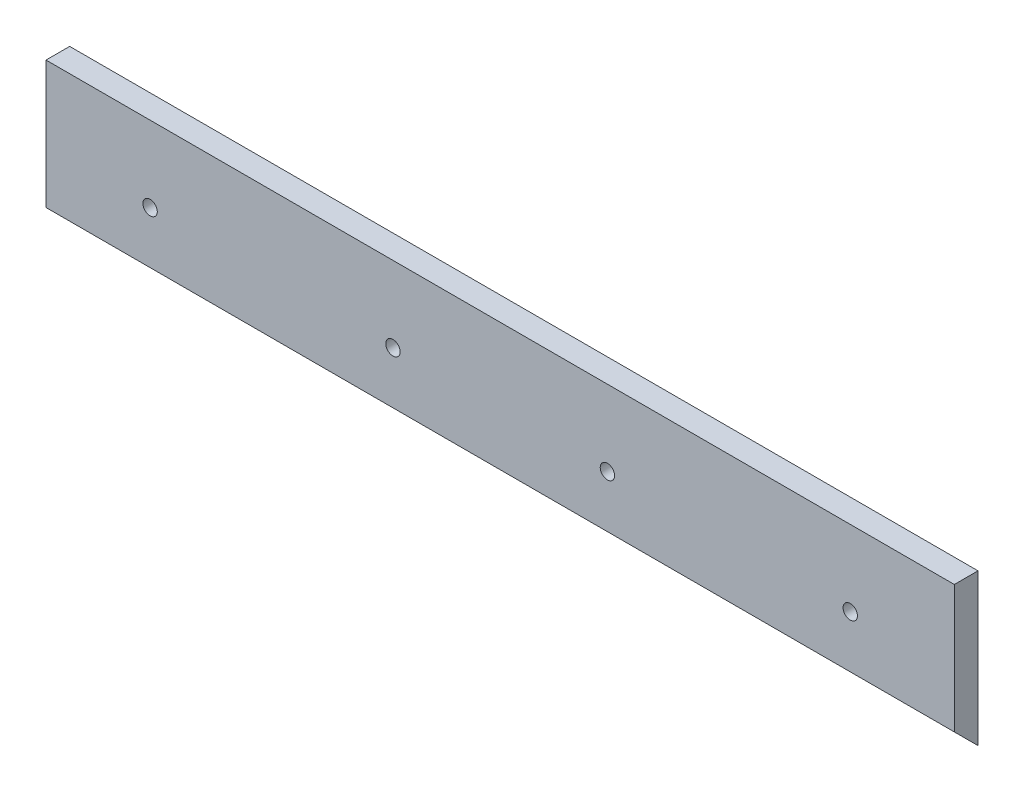
ISO-10303-21;
HEADER;
FILE_DESCRIPTION(('STEP AP214'),'2;1');
FILE_NAME('part.step','',(''),(''),'','','');
FILE_SCHEMA(('AUTOMOTIVE_DESIGN { 1 0 10303 214 1 1 1 1 }'));
ENDSEC;
DATA;
#1=APPLICATION_CONTEXT('core data for automotive mechanical design processes');
#2=APPLICATION_PROTOCOL_DEFINITION('international standard','automotive_design',2000,#1);
#3=PRODUCT_CONTEXT('',#1,'mechanical');
#4=PRODUCT('Part','Part','',(#3));
#5=PRODUCT_RELATED_PRODUCT_CATEGORY('part','',(#4));
#6=PRODUCT_DEFINITION_FORMATION('','',#4);
#7=PRODUCT_DEFINITION_CONTEXT('part definition',#1,'design');
#8=PRODUCT_DEFINITION('design','',#6,#7);
#9=PRODUCT_DEFINITION_SHAPE('','',#8);
#10=(LENGTH_UNIT() NAMED_UNIT(*) SI_UNIT(.MILLI.,.METRE.));
#11=(NAMED_UNIT(*) PLANE_ANGLE_UNIT() SI_UNIT($,.RADIAN.));
#12=(NAMED_UNIT(*) SI_UNIT($,.STERADIAN.) SOLID_ANGLE_UNIT());
#13=UNCERTAINTY_MEASURE_WITH_UNIT(LENGTH_MEASURE(1.E-05),#10,'distance_accuracy_value','');
#14=(GEOMETRIC_REPRESENTATION_CONTEXT(3) GLOBAL_UNCERTAINTY_ASSIGNED_CONTEXT((#13)) GLOBAL_UNIT_ASSIGNED_CONTEXT((#10,
#11,#12)) REPRESENTATION_CONTEXT('',''));
#15=CARTESIAN_POINT('',(0.,0.,0.));
#16=DIRECTION('',(0.,0.,1.));
#17=DIRECTION('',(1.,0.,0.));
#18=AXIS2_PLACEMENT_3D('',#15,#16,#17);
#19=CARTESIAN_POINT('',(-234.95,0.,7.9375));
#20=DIRECTION('',(0.,0.,-1.));
#21=DIRECTION('',(-1.,0.,0.));
#22=AXIS2_PLACEMENT_3D('',#19,#20,#21);
#23=CYLINDRICAL_SURFACE('',#22,4.82599999999999);
#24=CARTESIAN_POINT('',(-234.95,0.,7.9375));
#25=DIRECTION('',(0.,0.,-1.));
#26=DIRECTION('',(-1.,0.,0.));
#27=AXIS2_PLACEMENT_3D('',#24,#25,#26);
#28=CIRCLE('',#27,4.82599999999999);
#29=CARTESIAN_POINT('',(-239.776,0.,7.9375));
#30=VERTEX_POINT('',#29);
#31=EDGE_CURVE('E101',#30,#30,#28,.T.);
#32=ORIENTED_EDGE('',*,*,#31,.F.);
#33=EDGE_LOOP('',(#32));
#34=FACE_BOUND('',#33,.T.);
#35=CARTESIAN_POINT('',(-234.95,0.,0.1905));
#36=DIRECTION('',(0.,0.,-1.));
#37=DIRECTION('',(-1.,0.,0.));
#38=AXIS2_PLACEMENT_3D('',#35,#36,#37);
#39=CIRCLE('',#38,4.82599999999999);
#40=CARTESIAN_POINT('',(-239.776,0.,0.1905));
#41=VERTEX_POINT('',#40);
#42=EDGE_CURVE('E117',#41,#41,#39,.T.);
#43=ORIENTED_EDGE('',*,*,#42,.T.);
#44=EDGE_LOOP('',(#43));
#45=FACE_BOUND('',#44,.T.);
#46=ADVANCED_FACE('F34',(#34,#45),#23,.F.);
#47=CARTESIAN_POINT('',(-71.966666709,0.,7.9375));
#48=DIRECTION('',(0.,0.,-1.));
#49=DIRECTION('',(-1.,0.,0.));
#50=AXIS2_PLACEMENT_3D('',#47,#48,#49);
#51=CYLINDRICAL_SURFACE('',#50,4.826);
#52=CARTESIAN_POINT('',(-71.966666709,0.,7.9375));
#53=DIRECTION('',(0.,0.,-1.));
#54=DIRECTION('',(-1.,0.,0.));
#55=AXIS2_PLACEMENT_3D('',#52,#53,#54);
#56=CIRCLE('',#55,4.826);
#57=CARTESIAN_POINT('',(-76.792666709,0.,7.9375));
#58=VERTEX_POINT('',#57);
#59=EDGE_CURVE('E104',#58,#58,#56,.T.);
#60=ORIENTED_EDGE('',*,*,#59,.F.);
#61=EDGE_LOOP('',(#60));
#62=FACE_BOUND('',#61,.T.);
#63=CARTESIAN_POINT('',(-71.966666709,0.,0.1905));
#64=DIRECTION('',(0.,0.,-1.));
#65=DIRECTION('',(-1.,0.,0.));
#66=AXIS2_PLACEMENT_3D('',#63,#64,#65);
#67=CIRCLE('',#66,4.826);
#68=CARTESIAN_POINT('',(-76.792666709,0.,0.1905));
#69=VERTEX_POINT('',#68);
#70=EDGE_CURVE('E136',#69,#69,#67,.T.);
#71=ORIENTED_EDGE('',*,*,#70,.T.);
#72=EDGE_LOOP('',(#71));
#73=FACE_BOUND('',#72,.T.);
#74=ADVANCED_FACE('F188',(#62,#73),#51,.F.);
#75=CARTESIAN_POINT('',(71.966666709,0.,7.9375));
#76=DIRECTION('',(0.,0.,-1.));
#77=DIRECTION('',(-1.,0.,0.));
#78=AXIS2_PLACEMENT_3D('',#75,#76,#77);
#79=CYLINDRICAL_SURFACE('',#78,4.826);
#80=CARTESIAN_POINT('',(71.966666709,0.,7.9375));
#81=DIRECTION('',(0.,0.,-1.));
#82=DIRECTION('',(-1.,0.,0.));
#83=AXIS2_PLACEMENT_3D('',#80,#81,#82);
#84=CIRCLE('',#83,4.826);
#85=CARTESIAN_POINT('',(67.140666709,0.,7.9375));
#86=VERTEX_POINT('',#85);
#87=EDGE_CURVE('E108',#86,#86,#84,.T.);
#88=ORIENTED_EDGE('',*,*,#87,.F.);
#89=EDGE_LOOP('',(#88));
#90=FACE_BOUND('',#89,.T.);
#91=CARTESIAN_POINT('',(71.966666709,0.,0.1905));
#92=DIRECTION('',(0.,0.,-1.));
#93=DIRECTION('',(-1.,0.,0.));
#94=AXIS2_PLACEMENT_3D('',#91,#92,#93);
#95=CIRCLE('',#94,4.826);
#96=CARTESIAN_POINT('',(67.140666709,0.,0.1905));
#97=VERTEX_POINT('',#96);
#98=EDGE_CURVE('E120',#97,#97,#95,.T.);
#99=ORIENTED_EDGE('',*,*,#98,.T.);
#100=EDGE_LOOP('',(#99));
#101=FACE_BOUND('',#100,.T.);
#102=ADVANCED_FACE('F194',(#90,#101),#79,.F.);
#103=CARTESIAN_POINT('',(234.95,0.,7.9375));
#104=DIRECTION('',(0.,0.,-1.));
#105=DIRECTION('',(-1.,0.,0.));
#106=AXIS2_PLACEMENT_3D('',#103,#104,#105);
#107=CYLINDRICAL_SURFACE('',#106,4.82599999999999);
#108=CARTESIAN_POINT('',(234.95,0.,7.9375));
#109=DIRECTION('',(0.,0.,-1.));
#110=DIRECTION('',(-1.,0.,0.));
#111=AXIS2_PLACEMENT_3D('',#108,#109,#110);
#112=CIRCLE('',#111,4.82599999999999);
#113=CARTESIAN_POINT('',(230.124,0.,7.9375));
#114=VERTEX_POINT('',#113);
#115=EDGE_CURVE('E100',#114,#114,#112,.T.);
#116=ORIENTED_EDGE('',*,*,#115,.F.);
#117=EDGE_LOOP('',(#116));
#118=FACE_BOUND('',#117,.T.);
#119=CARTESIAN_POINT('',(234.95,0.,0.1905));
#120=DIRECTION('',(0.,0.,-1.));
#121=DIRECTION('',(-1.,0.,0.));
#122=AXIS2_PLACEMENT_3D('',#119,#120,#121);
#123=CIRCLE('',#122,4.82599999999999);
#124=CARTESIAN_POINT('',(230.124,0.,0.1905));
#125=VERTEX_POINT('',#124);
#126=EDGE_CURVE('E130',#125,#125,#123,.T.);
#127=ORIENTED_EDGE('',*,*,#126,.T.);
#128=EDGE_LOOP('',(#127));
#129=FACE_BOUND('',#128,.T.);
#130=ADVANCED_FACE('F149',(#118,#129),#107,.F.);
#131=CARTESIAN_POINT('',(-304.8,50.8,7.9375));
#132=DIRECTION('',(1.,0.,0.));
#133=DIRECTION('',(0.,0.,-1.));
#134=AXIS2_PLACEMENT_3D('',#131,#132,#133);
#135=PLANE('',#134);
#136=DIRECTION('',(0.,-1.,0.));
#137=VECTOR('',#136,1.);
#138=CARTESIAN_POINT('',(-304.8,50.8,-7.9375));
#139=LINE('',#138,#137);
#140=CARTESIAN_POINT('',(-304.8,50.8,-7.9375));
#141=VERTEX_POINT('',#140);
#142=CARTESIAN_POINT('',(-304.8,-50.8,-7.9375));
#143=VERTEX_POINT('',#142);
#144=EDGE_CURVE('E80',#141,#143,#139,.T.);
#145=ORIENTED_EDGE('',*,*,#144,.T.);
#146=DIRECTION('',(0.,0.707106781186543,0.707106781186552));
#147=VECTOR('',#146,1.);
#148=CARTESIAN_POINT('',(-304.8,-50.7999999999999,-7.9375));
#149=LINE('',#148,#147);
#150=CARTESIAN_POINT('',(-304.8,-34.9250000000001,7.9375));
#151=VERTEX_POINT('',#150);
#152=EDGE_CURVE('E98',#143,#151,#149,.T.);
#153=ORIENTED_EDGE('',*,*,#152,.T.);
#154=DIRECTION('',(0.,-1.,0.));
#155=VECTOR('',#154,1.);
#156=CARTESIAN_POINT('',(-304.8,50.8,7.9375));
#157=LINE('',#156,#155);
#158=CARTESIAN_POINT('',(-304.8,50.8,7.9375));
#159=VERTEX_POINT('',#158);
#160=EDGE_CURVE('E75',#159,#151,#157,.T.);
#161=ORIENTED_EDGE('',*,*,#160,.F.);
#162=DIRECTION('',(0.,0.,-1.));
#163=VECTOR('',#162,1.);
#164=CARTESIAN_POINT('',(-304.8,50.8,7.9375));
#165=LINE('',#164,#163);
#166=EDGE_CURVE('E43',#159,#141,#165,.T.);
#167=ORIENTED_EDGE('',*,*,#166,.T.);
#168=EDGE_LOOP('',(#145,#153,#161,#167));
#169=FACE_BOUND('',#168,.T.);
#170=ADVANCED_FACE('F36',(#169),#135,.F.);
#171=CARTESIAN_POINT('',(304.8,50.8,7.9375));
#172=DIRECTION('',(-1.,0.,0.));
#173=DIRECTION('',(0.,0.,1.));
#174=AXIS2_PLACEMENT_3D('',#171,#172,#173);
#175=PLANE('',#174);
#176=DIRECTION('',(0.,1.,0.));
#177=VECTOR('',#176,1.);
#178=CARTESIAN_POINT('',(304.8,50.8,7.9375));
#179=LINE('',#178,#177);
#180=CARTESIAN_POINT('',(304.8,-34.9250000000001,7.9375));
#181=VERTEX_POINT('',#180);
#182=CARTESIAN_POINT('',(304.8,50.8,7.9375));
#183=VERTEX_POINT('',#182);
#184=EDGE_CURVE('E93',#181,#183,#179,.T.);
#185=ORIENTED_EDGE('',*,*,#184,.F.);
#186=DIRECTION('',(0.,-0.707106781186543,-0.707106781186552));
#187=VECTOR('',#186,1.);
#188=CARTESIAN_POINT('',(304.8,7.93749999999945,50.8000000000001));
#189=LINE('',#188,#187);
#190=CARTESIAN_POINT('',(304.8,-50.7999999999999,-7.9375));
#191=VERTEX_POINT('',#190);
#192=EDGE_CURVE('E85',#181,#191,#189,.T.);
#193=ORIENTED_EDGE('',*,*,#192,.T.);
#194=DIRECTION('',(0.,1.,0.));
#195=VECTOR('',#194,1.);
#196=CARTESIAN_POINT('',(304.8,50.8,-7.9375));
#197=LINE('',#196,#195);
#198=CARTESIAN_POINT('',(304.8,50.8,-7.9375));
#199=VERTEX_POINT('',#198);
#200=EDGE_CURVE('E65',#191,#199,#197,.T.);
#201=ORIENTED_EDGE('',*,*,#200,.T.);
#202=DIRECTION('',(0.,0.,-1.));
#203=VECTOR('',#202,1.);
#204=CARTESIAN_POINT('',(304.8,50.8,7.9375));
#205=LINE('',#204,#203);
#206=EDGE_CURVE('E11',#183,#199,#205,.T.);
#207=ORIENTED_EDGE('',*,*,#206,.F.);
#208=EDGE_LOOP('',(#185,#193,#201,#207));
#209=FACE_BOUND('',#208,.T.);
#210=ADVANCED_FACE('F208',(#209),#175,.F.);
#211=CARTESIAN_POINT('',(304.8,50.8,7.9375));
#212=DIRECTION('',(0.,-1.,0.));
#213=DIRECTION('',(1.,0.,0.));
#214=AXIS2_PLACEMENT_3D('',#211,#212,#213);
#215=PLANE('',#214);
#216=DIRECTION('',(-1.,0.,0.));
#217=VECTOR('',#216,1.);
#218=CARTESIAN_POINT('',(304.8,50.8,-7.9375));
#219=LINE('',#218,#217);
#220=EDGE_CURVE('E69',#199,#141,#219,.T.);
#221=ORIENTED_EDGE('',*,*,#220,.T.);
#222=ORIENTED_EDGE('',*,*,#166,.F.);
#223=DIRECTION('',(-1.,0.,0.));
#224=VECTOR('',#223,1.);
#225=CARTESIAN_POINT('',(304.8,50.8,7.9375));
#226=LINE('',#225,#224);
#227=EDGE_CURVE('E51',#183,#159,#226,.T.);
#228=ORIENTED_EDGE('',*,*,#227,.F.);
#229=ORIENTED_EDGE('',*,*,#206,.T.);
#230=EDGE_LOOP('',(#221,#222,#228,#229));
#231=FACE_BOUND('',#230,.T.);
#232=ADVANCED_FACE('F71',(#231),#215,.F.);
#233=CARTESIAN_POINT('',(0.,0.,7.9375));
#234=DIRECTION('',(0.,0.,-1.));
#235=DIRECTION('',(-1.,0.,0.));
#236=AXIS2_PLACEMENT_3D('',#233,#234,#235);
#237=PLANE('',#236);
#238=ORIENTED_EDGE('',*,*,#115,.T.);
#239=EDGE_LOOP('',(#238));
#240=FACE_BOUND('',#239,.T.);
#241=ORIENTED_EDGE('',*,*,#87,.T.);
#242=EDGE_LOOP('',(#241));
#243=FACE_BOUND('',#242,.T.);
#244=ORIENTED_EDGE('',*,*,#59,.T.);
#245=EDGE_LOOP('',(#244));
#246=FACE_BOUND('',#245,.T.);
#247=ORIENTED_EDGE('',*,*,#31,.T.);
#248=EDGE_LOOP('',(#247));
#249=FACE_BOUND('',#248,.T.);
#250=ORIENTED_EDGE('',*,*,#160,.T.);
#251=DIRECTION('',(1.,0.,0.));
#252=VECTOR('',#251,1.);
#253=CARTESIAN_POINT('',(-304.8,-34.9250000000001,7.9375));
#254=LINE('',#253,#252);
#255=EDGE_CURVE('E88',#151,#181,#254,.T.);
#256=ORIENTED_EDGE('',*,*,#255,.T.);
#257=ORIENTED_EDGE('',*,*,#184,.T.);
#258=ORIENTED_EDGE('',*,*,#227,.T.);
#259=EDGE_LOOP('',(#250,#256,#257,#258));
#260=FACE_BOUND('',#259,.T.);
#261=ADVANCED_FACE('F167',(#240,#243,#246,#249,#260),#237,.F.);
#262=CARTESIAN_POINT('',(0.,0.,-7.9375));
#263=DIRECTION('',(0.,0.,-1.));
#264=DIRECTION('',(-1.,0.,0.));
#265=AXIS2_PLACEMENT_3D('',#262,#263,#264);
#266=PLANE('',#265);
#267=CARTESIAN_POINT('',(234.95,0.,-7.9375));
#268=DIRECTION('',(0.,0.,-1.));
#269=DIRECTION('',(-1.,0.,0.));
#270=AXIS2_PLACEMENT_3D('',#267,#268,#269);
#271=CIRCLE('',#270,13.1826);
#272=CARTESIAN_POINT('',(221.7674,0.,-7.9375));
#273=VERTEX_POINT('',#272);
#274=EDGE_CURVE('E141',#273,#273,#271,.T.);
#275=ORIENTED_EDGE('',*,*,#274,.F.);
#276=EDGE_LOOP('',(#275));
#277=FACE_BOUND('',#276,.T.);
#278=CARTESIAN_POINT('',(-71.966666709,0.,-7.9375));
#279=DIRECTION('',(0.,0.,-1.));
#280=DIRECTION('',(-1.,0.,0.));
#281=AXIS2_PLACEMENT_3D('',#278,#279,#280);
#282=CIRCLE('',#281,13.1826);
#283=CARTESIAN_POINT('',(-85.149266709,0.,-7.9375));
#284=VERTEX_POINT('',#283);
#285=EDGE_CURVE('E133',#284,#284,#282,.T.);
#286=ORIENTED_EDGE('',*,*,#285,.F.);
#287=EDGE_LOOP('',(#286));
#288=FACE_BOUND('',#287,.T.);
#289=CARTESIAN_POINT('',(-234.95,0.,-7.9375));
#290=DIRECTION('',(0.,0.,-1.));
#291=DIRECTION('',(-1.,0.,0.));
#292=AXIS2_PLACEMENT_3D('',#289,#290,#291);
#293=CIRCLE('',#292,13.1826);
#294=CARTESIAN_POINT('',(-248.1326,0.,-7.9375));
#295=VERTEX_POINT('',#294);
#296=EDGE_CURVE('E113',#295,#295,#293,.T.);
#297=ORIENTED_EDGE('',*,*,#296,.F.);
#298=EDGE_LOOP('',(#297));
#299=FACE_BOUND('',#298,.T.);
#300=CARTESIAN_POINT('',(71.966666709,0.,-7.9375));
#301=DIRECTION('',(0.,0.,-1.));
#302=DIRECTION('',(-1.,0.,0.));
#303=AXIS2_PLACEMENT_3D('',#300,#301,#302);
#304=CIRCLE('',#303,13.1826);
#305=CARTESIAN_POINT('',(58.784066709,0.,-7.9375));
#306=VERTEX_POINT('',#305);
#307=EDGE_CURVE('E124',#306,#306,#304,.T.);
#308=ORIENTED_EDGE('',*,*,#307,.F.);
#309=EDGE_LOOP('',(#308));
#310=FACE_BOUND('',#309,.T.);
#311=ORIENTED_EDGE('',*,*,#144,.F.);
#312=ORIENTED_EDGE('',*,*,#220,.F.);
#313=ORIENTED_EDGE('',*,*,#200,.F.);
#314=DIRECTION('',(1.,0.,0.));
#315=VECTOR('',#314,1.);
#316=CARTESIAN_POINT('',(304.8,-50.7999999999999,-7.9375));
#317=LINE('',#316,#315);
#318=EDGE_CURVE('E84',#143,#191,#317,.T.);
#319=ORIENTED_EDGE('',*,*,#318,.F.);
#320=EDGE_LOOP('',(#311,#312,#313,#319));
#321=FACE_BOUND('',#320,.T.);
#322=ADVANCED_FACE('F82',(#277,#288,#299,#310,#321),#266,.T.);
#323=CARTESIAN_POINT('',(-304.8,-50.7999999999999,-7.9375));
#324=DIRECTION('',(0.,0.707106781186552,-0.707106781186543));
#325=DIRECTION('',(0.,0.707106781186543,0.707106781186552));
#326=AXIS2_PLACEMENT_3D('',#323,#324,#325);
#327=PLANE('',#326);
#328=ORIENTED_EDGE('',*,*,#255,.F.);
#329=ORIENTED_EDGE('',*,*,#152,.F.);
#330=ORIENTED_EDGE('',*,*,#318,.T.);
#331=ORIENTED_EDGE('',*,*,#192,.F.);
#332=EDGE_LOOP('',(#328,#329,#330,#331));
#333=FACE_BOUND('',#332,.T.);
#334=ADVANCED_FACE('F161',(#333),#327,.F.);
#335=CARTESIAN_POINT('',(234.95,0.,0.1905));
#336=DIRECTION('',(0.,0.,-1.));
#337=DIRECTION('',(-1.,0.,0.));
#338=AXIS2_PLACEMENT_3D('',#335,#336,#337);
#339=CYLINDRICAL_SURFACE('',#338,13.1826);
#340=CARTESIAN_POINT('',(234.95,0.,0.1905));
#341=DIRECTION('',(0.,0.,-1.));
#342=DIRECTION('',(-1.,0.,0.));
#343=AXIS2_PLACEMENT_3D('',#340,#341,#342);
#344=CIRCLE('',#343,13.1826);
#345=CARTESIAN_POINT('',(221.7674,0.,0.1905));
#346=VERTEX_POINT('',#345);
#347=EDGE_CURVE('E105',#346,#346,#344,.T.);
#348=ORIENTED_EDGE('',*,*,#347,.F.);
#349=EDGE_LOOP('',(#348));
#350=FACE_BOUND('',#349,.T.);
#351=ORIENTED_EDGE('',*,*,#274,.T.);
#352=EDGE_LOOP('',(#351));
#353=FACE_BOUND('',#352,.T.);
#354=ADVANCED_FACE('F155',(#350,#353),#339,.F.);
#355=CARTESIAN_POINT('',(234.95,0.,0.1905));
#356=DIRECTION('',(0.,0.,-1.));
#357=DIRECTION('',(-1.,0.,0.));
#358=AXIS2_PLACEMENT_3D('',#355,#356,#357);
#359=PLANE('',#358);
#360=ORIENTED_EDGE('',*,*,#126,.F.);
#361=EDGE_LOOP('',(#360));
#362=FACE_BOUND('',#361,.T.);
#363=ORIENTED_EDGE('',*,*,#347,.T.);
#364=EDGE_LOOP('',(#363));
#365=FACE_BOUND('',#364,.T.);
#366=ADVANCED_FACE('F151',(#362,#365),#359,.T.);
#367=CARTESIAN_POINT('',(71.966666709,0.,0.1905));
#368=DIRECTION('',(0.,0.,-1.));
#369=DIRECTION('',(-1.,0.,0.));
#370=AXIS2_PLACEMENT_3D('',#367,#368,#369);
#371=CYLINDRICAL_SURFACE('',#370,13.1826);
#372=CARTESIAN_POINT('',(71.966666709,0.,0.1905));
#373=DIRECTION('',(0.,0.,-1.));
#374=DIRECTION('',(-1.,0.,0.));
#375=AXIS2_PLACEMENT_3D('',#372,#373,#374);
#376=CIRCLE('',#375,13.1826);
#377=CARTESIAN_POINT('',(58.784066709,0.,0.1905));
#378=VERTEX_POINT('',#377);
#379=EDGE_CURVE('E127',#378,#378,#376,.T.);
#380=ORIENTED_EDGE('',*,*,#379,.F.);
#381=EDGE_LOOP('',(#380));
#382=FACE_BOUND('',#381,.T.);
#383=ORIENTED_EDGE('',*,*,#307,.T.);
#384=EDGE_LOOP('',(#383));
#385=FACE_BOUND('',#384,.T.);
#386=ADVANCED_FACE('F154',(#382,#385),#371,.F.);
#387=CARTESIAN_POINT('',(71.966666709,0.,0.1905));
#388=DIRECTION('',(0.,0.,-1.));
#389=DIRECTION('',(-1.,0.,0.));
#390=AXIS2_PLACEMENT_3D('',#387,#388,#389);
#391=PLANE('',#390);
#392=ORIENTED_EDGE('',*,*,#98,.F.);
#393=EDGE_LOOP('',(#392));
#394=FACE_BOUND('',#393,.T.);
#395=ORIENTED_EDGE('',*,*,#379,.T.);
#396=EDGE_LOOP('',(#395));
#397=FACE_BOUND('',#396,.T.);
#398=ADVANCED_FACE('F176',(#394,#397),#391,.T.);
#399=CARTESIAN_POINT('',(-71.966666709,0.,0.1905));
#400=DIRECTION('',(0.,0.,-1.));
#401=DIRECTION('',(-1.,0.,0.));
#402=AXIS2_PLACEMENT_3D('',#399,#400,#401);
#403=CYLINDRICAL_SURFACE('',#402,13.1826);
#404=CARTESIAN_POINT('',(-71.966666709,0.,0.1905));
#405=DIRECTION('',(0.,0.,-1.));
#406=DIRECTION('',(-1.,0.,0.));
#407=AXIS2_PLACEMENT_3D('',#404,#405,#406);
#408=CIRCLE('',#407,13.1826);
#409=CARTESIAN_POINT('',(-85.149266709,0.,0.1905));
#410=VERTEX_POINT('',#409);
#411=EDGE_CURVE('E123',#410,#410,#408,.T.);
#412=ORIENTED_EDGE('',*,*,#411,.F.);
#413=EDGE_LOOP('',(#412));
#414=FACE_BOUND('',#413,.T.);
#415=ORIENTED_EDGE('',*,*,#285,.T.);
#416=EDGE_LOOP('',(#415));
#417=FACE_BOUND('',#416,.T.);
#418=ADVANCED_FACE('F182',(#414,#417),#403,.F.);
#419=CARTESIAN_POINT('',(-71.966666709,0.,0.1905));
#420=DIRECTION('',(0.,0.,-1.));
#421=DIRECTION('',(-1.,0.,0.));
#422=AXIS2_PLACEMENT_3D('',#419,#420,#421);
#423=PLANE('',#422);
#424=ORIENTED_EDGE('',*,*,#70,.F.);
#425=EDGE_LOOP('',(#424));
#426=FACE_BOUND('',#425,.T.);
#427=ORIENTED_EDGE('',*,*,#411,.T.);
#428=EDGE_LOOP('',(#427));
#429=FACE_BOUND('',#428,.T.);
#430=ADVANCED_FACE('F234',(#426,#429),#423,.T.);
#431=CARTESIAN_POINT('',(-234.95,0.,0.1905));
#432=DIRECTION('',(0.,0.,-1.));
#433=DIRECTION('',(-1.,0.,0.));
#434=AXIS2_PLACEMENT_3D('',#431,#432,#433);
#435=CYLINDRICAL_SURFACE('',#434,13.1826);
#436=CARTESIAN_POINT('',(-234.95,0.,0.1905));
#437=DIRECTION('',(0.,0.,-1.));
#438=DIRECTION('',(-1.,0.,0.));
#439=AXIS2_PLACEMENT_3D('',#436,#437,#438);
#440=CIRCLE('',#439,13.1826);
#441=CARTESIAN_POINT('',(-248.1326,0.,0.1905));
#442=VERTEX_POINT('',#441);
#443=EDGE_CURVE('E116',#442,#442,#440,.T.);
#444=ORIENTED_EDGE('',*,*,#443,.F.);
#445=EDGE_LOOP('',(#444));
#446=FACE_BOUND('',#445,.T.);
#447=ORIENTED_EDGE('',*,*,#296,.T.);
#448=EDGE_LOOP('',(#447));
#449=FACE_BOUND('',#448,.T.);
#450=ADVANCED_FACE('F231',(#446,#449),#435,.F.);
#451=CARTESIAN_POINT('',(-234.95,0.,0.1905));
#452=DIRECTION('',(0.,0.,-1.));
#453=DIRECTION('',(-1.,0.,0.));
#454=AXIS2_PLACEMENT_3D('',#451,#452,#453);
#455=PLANE('',#454);
#456=ORIENTED_EDGE('',*,*,#42,.F.);
#457=EDGE_LOOP('',(#456));
#458=FACE_BOUND('',#457,.T.);
#459=ORIENTED_EDGE('',*,*,#443,.T.);
#460=EDGE_LOOP('',(#459));
#461=FACE_BOUND('',#460,.T.);
#462=ADVANCED_FACE('F233',(#458,#461),#455,.T.);
#463=CLOSED_SHELL('',(#46,#74,#102,#130,#170,#210,#232,#261,#322,#334,#354,#366,#386,#398,#418,
#430,#450,#462));
#464=MANIFOLD_SOLID_BREP('B2',#463);
#465=ADVANCED_BREP_SHAPE_REPRESENTATION('',(#18,#464),#14);
#466=SHAPE_DEFINITION_REPRESENTATION(#9,#465);
ENDSEC;
END-ISO-10303-21;
